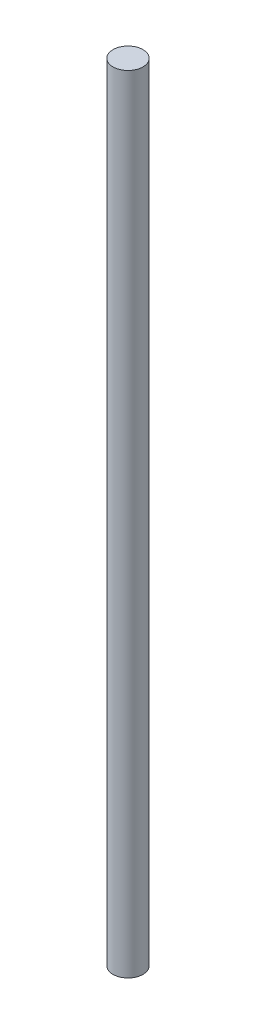
ISO-10303-21;
HEADER;
FILE_DESCRIPTION(('STEP AP214'),'2;1');
FILE_NAME('part.step','',(''),(''),'','','');
FILE_SCHEMA(('AUTOMOTIVE_DESIGN { 1 0 10303 214 1 1 1 1 }'));
ENDSEC;
DATA;
#1=APPLICATION_CONTEXT('core data for automotive mechanical design processes');
#2=APPLICATION_PROTOCOL_DEFINITION('international standard','automotive_design',2000,#1);
#3=PRODUCT_CONTEXT('',#1,'mechanical');
#4=PRODUCT('Part','Part','',(#3));
#5=PRODUCT_RELATED_PRODUCT_CATEGORY('part','',(#4));
#6=PRODUCT_DEFINITION_FORMATION('','',#4);
#7=PRODUCT_DEFINITION_CONTEXT('part definition',#1,'design');
#8=PRODUCT_DEFINITION('design','',#6,#7);
#9=PRODUCT_DEFINITION_SHAPE('','',#8);
#10=(LENGTH_UNIT() NAMED_UNIT(*) SI_UNIT(.MILLI.,.METRE.));
#11=(NAMED_UNIT(*) PLANE_ANGLE_UNIT() SI_UNIT($,.RADIAN.));
#12=(NAMED_UNIT(*) SI_UNIT($,.STERADIAN.) SOLID_ANGLE_UNIT());
#13=UNCERTAINTY_MEASURE_WITH_UNIT(LENGTH_MEASURE(1.E-05),#10,'distance_accuracy_value','');
#14=(GEOMETRIC_REPRESENTATION_CONTEXT(3) GLOBAL_UNCERTAINTY_ASSIGNED_CONTEXT((#13)) GLOBAL_UNIT_ASSIGNED_CONTEXT((#10,
#11,#12)) REPRESENTATION_CONTEXT('',''));
#15=CARTESIAN_POINT('',(0.,0.,0.));
#16=DIRECTION('',(0.,0.,1.));
#17=DIRECTION('',(1.,0.,0.));
#18=AXIS2_PLACEMENT_3D('',#15,#16,#17);
#19=CARTESIAN_POINT('',(0.,262.,0.));
#20=DIRECTION('',(0.,-1.,0.));
#21=DIRECTION('',(0.,0.,-1.));
#22=AXIS2_PLACEMENT_3D('',#19,#20,#21);
#23=CYLINDRICAL_SURFACE('',#22,5.);
#24=CARTESIAN_POINT('',(0.,262.,0.));
#25=DIRECTION('',(0.,1.,0.));
#26=DIRECTION('',(0.,0.,1.));
#27=AXIS2_PLACEMENT_3D('',#24,#25,#26);
#28=CIRCLE('',#27,5.);
#29=CARTESIAN_POINT('',(0.,262.,5.));
#30=VERTEX_POINT('',#29);
#31=EDGE_CURVE('E10',#30,#30,#28,.T.);
#32=ORIENTED_EDGE('',*,*,#31,.F.);
#33=EDGE_LOOP('',(#32));
#34=FACE_BOUND('',#33,.T.);
#35=CARTESIAN_POINT('',(0.,0.,0.));
#36=DIRECTION('',(0.,1.,0.));
#37=DIRECTION('',(0.,0.,1.));
#38=AXIS2_PLACEMENT_3D('',#35,#36,#37);
#39=CIRCLE('',#38,5.);
#40=CARTESIAN_POINT('',(0.,0.,5.));
#41=VERTEX_POINT('',#40);
#42=EDGE_CURVE('E37',#41,#41,#39,.T.);
#43=ORIENTED_EDGE('',*,*,#42,.T.);
#44=EDGE_LOOP('',(#43));
#45=FACE_BOUND('',#44,.T.);
#46=ADVANCED_FACE('F34',(#34,#45),#23,.T.);
#47=CARTESIAN_POINT('',(0.,262.,0.));
#48=DIRECTION('',(0.,1.,0.));
#49=DIRECTION('',(0.,0.,1.));
#50=AXIS2_PLACEMENT_3D('',#47,#48,#49);
#51=PLANE('',#50);
#52=ORIENTED_EDGE('',*,*,#31,.T.);
#53=EDGE_LOOP('',(#52));
#54=FACE_BOUND('',#53,.T.);
#55=ADVANCED_FACE('F49',(#54),#51,.T.);
#56=CARTESIAN_POINT('',(0.,0.,0.));
#57=DIRECTION('',(0.,1.,0.));
#58=DIRECTION('',(0.,0.,1.));
#59=AXIS2_PLACEMENT_3D('',#56,#57,#58);
#60=PLANE('',#59);
#61=ORIENTED_EDGE('',*,*,#42,.F.);
#62=EDGE_LOOP('',(#61));
#63=FACE_BOUND('',#62,.T.);
#64=ADVANCED_FACE('F47',(#63),#60,.F.);
#65=CLOSED_SHELL('',(#46,#55,#64));
#66=MANIFOLD_SOLID_BREP('B2',#65);
#67=ADVANCED_BREP_SHAPE_REPRESENTATION('',(#18,#66),#14);
#68=SHAPE_DEFINITION_REPRESENTATION(#9,#67);
ENDSEC;
END-ISO-10303-21;
